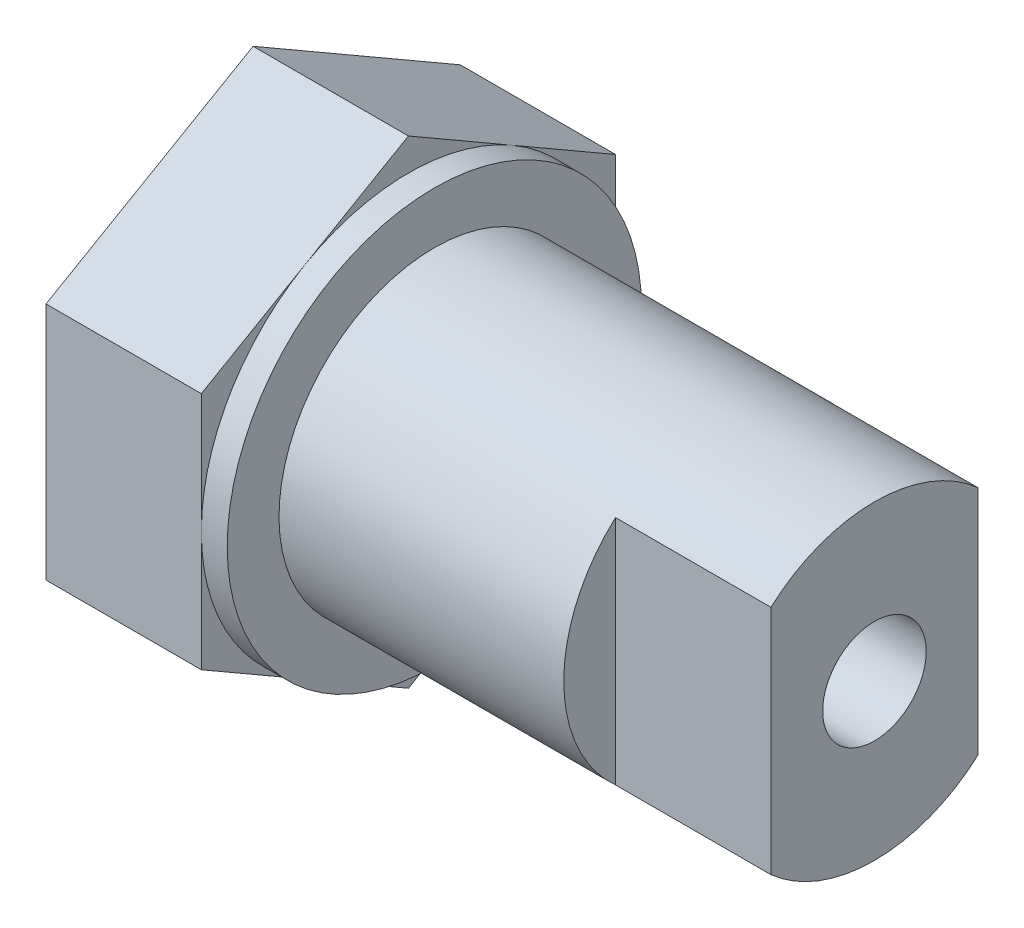
ISO-10303-21;
HEADER;
FILE_DESCRIPTION(('STEP AP214'),'2;1');
FILE_NAME('part.step','',(''),(''),'','','');
FILE_SCHEMA(('AUTOMOTIVE_DESIGN { 1 0 10303 214 1 1 1 1 }'));
ENDSEC;
DATA;
#1=APPLICATION_CONTEXT('core data for automotive mechanical design processes');
#2=APPLICATION_PROTOCOL_DEFINITION('international standard','automotive_design',2000,#1);
#3=PRODUCT_CONTEXT('',#1,'mechanical');
#4=PRODUCT('Part','Part','',(#3));
#5=PRODUCT_RELATED_PRODUCT_CATEGORY('part','',(#4));
#6=PRODUCT_DEFINITION_FORMATION('','',#4);
#7=PRODUCT_DEFINITION_CONTEXT('part definition',#1,'design');
#8=PRODUCT_DEFINITION('design','',#6,#7);
#9=PRODUCT_DEFINITION_SHAPE('','',#8);
#10=(LENGTH_UNIT() NAMED_UNIT(*) SI_UNIT(.MILLI.,.METRE.));
#11=(NAMED_UNIT(*) PLANE_ANGLE_UNIT() SI_UNIT($,.RADIAN.));
#12=(NAMED_UNIT(*) SI_UNIT($,.STERADIAN.) SOLID_ANGLE_UNIT());
#13=UNCERTAINTY_MEASURE_WITH_UNIT(LENGTH_MEASURE(1.E-05),#10,'distance_accuracy_value','');
#14=(GEOMETRIC_REPRESENTATION_CONTEXT(3) GLOBAL_UNCERTAINTY_ASSIGNED_CONTEXT((#13)) GLOBAL_UNIT_ASSIGNED_CONTEXT((#10,
#11,#12)) REPRESENTATION_CONTEXT('',''));
#15=CARTESIAN_POINT('',(0.,0.,0.));
#16=DIRECTION('',(0.,0.,1.));
#17=DIRECTION('',(1.,0.,0.));
#18=AXIS2_PLACEMENT_3D('',#15,#16,#17);
#19=CARTESIAN_POINT('',(114.3,0.,0.));
#20=DIRECTION('',(-1.,0.,0.));
#21=DIRECTION('',(0.,0.,1.));
#22=AXIS2_PLACEMENT_3D('',#19,#20,#21);
#23=CYLINDRICAL_SURFACE('',#22,38.1);
#24=CARTESIAN_POINT('',(6.35,0.,0.));
#25=DIRECTION('',(1.,0.,0.));
#26=DIRECTION('',(0.,0.,-1.));
#27=AXIS2_PLACEMENT_3D('',#24,#25,#26);
#28=CIRCLE('',#27,38.1);
#29=CARTESIAN_POINT('',(6.35,0.,-38.1));
#30=VERTEX_POINT('',#29);
#31=EDGE_CURVE('E11',#30,#30,#28,.T.);
#32=ORIENTED_EDGE('',*,*,#31,.T.);
#33=EDGE_LOOP('',(#32));
#34=FACE_BOUND('',#33,.T.);
#35=DIRECTION('',(1.,0.,0.));
#36=VECTOR('',#35,1.);
#37=CARTESIAN_POINT('',(76.2,28.3980633142473,25.4));
#38=LINE('',#37,#36);
#39=CARTESIAN_POINT('',(76.2,28.3980633142473,25.4));
#40=VERTEX_POINT('',#39);
#41=CARTESIAN_POINT('',(114.3,28.3980633142473,25.4));
#42=VERTEX_POINT('',#41);
#43=EDGE_CURVE('E135',#40,#42,#38,.T.);
#44=ORIENTED_EDGE('',*,*,#43,.T.);
#45=CARTESIAN_POINT('',(114.3,0.,0.));
#46=DIRECTION('',(1.,0.,0.));
#47=DIRECTION('',(0.,0.,-1.));
#48=AXIS2_PLACEMENT_3D('',#45,#46,#47);
#49=CIRCLE('',#48,38.1);
#50=CARTESIAN_POINT('',(114.3,28.3980633142473,-25.4));
#51=VERTEX_POINT('',#50);
#52=EDGE_CURVE('E173',#51,#42,#49,.T.);
#53=ORIENTED_EDGE('',*,*,#52,.F.);
#54=DIRECTION('',(1.,0.,0.));
#55=VECTOR('',#54,1.);
#56=CARTESIAN_POINT('',(76.2,28.3980633142473,-25.4));
#57=LINE('',#56,#55);
#58=CARTESIAN_POINT('',(76.2,28.3980633142473,-25.4));
#59=VERTEX_POINT('',#58);
#60=EDGE_CURVE('E64',#59,#51,#57,.T.);
#61=ORIENTED_EDGE('',*,*,#60,.F.);
#62=CARTESIAN_POINT('',(76.2,0.,0.));
#63=DIRECTION('',(1.,0.,0.));
#64=DIRECTION('',(0.,0.,-1.));
#65=AXIS2_PLACEMENT_3D('',#62,#63,#64);
#66=CIRCLE('',#65,38.1);
#67=CARTESIAN_POINT('',(76.2,-28.3980633142473,-25.4));
#68=VERTEX_POINT('',#67);
#69=EDGE_CURVE('E157',#68,#59,#66,.T.);
#70=ORIENTED_EDGE('',*,*,#69,.F.);
#71=DIRECTION('',(1.,0.,0.));
#72=VECTOR('',#71,1.);
#73=CARTESIAN_POINT('',(76.2,-28.3980633142473,-25.4));
#74=LINE('',#73,#72);
#75=CARTESIAN_POINT('',(114.3,-28.3980633142473,-25.4));
#76=VERTEX_POINT('',#75);
#77=EDGE_CURVE('E154',#68,#76,#74,.T.);
#78=ORIENTED_EDGE('',*,*,#77,.T.);
#79=CARTESIAN_POINT('',(114.3,-28.3980633142473,25.4));
#80=VERTEX_POINT('',#79);
#81=EDGE_CURVE('E170',#80,#76,#49,.T.);
#82=ORIENTED_EDGE('',*,*,#81,.F.);
#83=DIRECTION('',(1.,0.,0.));
#84=VECTOR('',#83,1.);
#85=CARTESIAN_POINT('',(76.2,-28.3980633142473,25.4));
#86=LINE('',#85,#84);
#87=CARTESIAN_POINT('',(76.2,-28.3980633142473,25.4));
#88=VERTEX_POINT('',#87);
#89=EDGE_CURVE('E56',#88,#80,#86,.T.);
#90=ORIENTED_EDGE('',*,*,#89,.F.);
#91=CARTESIAN_POINT('',(76.2,0.,0.));
#92=DIRECTION('',(1.,0.,0.));
#93=DIRECTION('',(0.,0.,-1.));
#94=AXIS2_PLACEMENT_3D('',#91,#92,#93);
#95=CIRCLE('',#94,38.1);
#96=EDGE_CURVE('E145',#40,#88,#95,.T.);
#97=ORIENTED_EDGE('',*,*,#96,.F.);
#98=EDGE_LOOP('',(#44,#53,#61,#70,#78,#82,#90,#97));
#99=FACE_BOUND('',#98,.T.);
#100=ADVANCED_FACE('F39',(#34,#99),#23,.T.);
#101=CARTESIAN_POINT('',(114.3,0.,0.));
#102=DIRECTION('',(1.,0.,0.));
#103=DIRECTION('',(0.,0.,-1.));
#104=AXIS2_PLACEMENT_3D('',#101,#102,#103);
#105=PLANE('',#104);
#106=CARTESIAN_POINT('',(114.3,0.,0.));
#107=DIRECTION('',(1.,0.,0.));
#108=DIRECTION('',(0.,0.,-1.));
#109=AXIS2_PLACEMENT_3D('',#106,#107,#108);
#110=CIRCLE('',#109,12.7);
#111=CARTESIAN_POINT('',(114.3,0.,-12.7));
#112=VERTEX_POINT('',#111);
#113=EDGE_CURVE('E155',#112,#112,#110,.T.);
#114=ORIENTED_EDGE('',*,*,#113,.F.);
#115=EDGE_LOOP('',(#114));
#116=FACE_BOUND('',#115,.T.);
#117=ORIENTED_EDGE('',*,*,#52,.T.);
#118=DIRECTION('',(0.,-1.,0.));
#119=VECTOR('',#118,1.);
#120=CARTESIAN_POINT('',(114.3,0.,25.4));
#121=LINE('',#120,#119);
#122=EDGE_CURVE('E140',#42,#80,#121,.T.);
#123=ORIENTED_EDGE('',*,*,#122,.T.);
#124=ORIENTED_EDGE('',*,*,#81,.T.);
#125=DIRECTION('',(0.,-1.,0.));
#126=VECTOR('',#125,1.);
#127=CARTESIAN_POINT('',(114.3,0.,-25.4));
#128=LINE('',#127,#126);
#129=EDGE_CURVE('E160',#51,#76,#128,.T.);
#130=ORIENTED_EDGE('',*,*,#129,.F.);
#131=EDGE_LOOP('',(#117,#123,#124,#130));
#132=FACE_BOUND('',#131,.T.);
#133=ADVANCED_FACE('F283',(#116,#132),#105,.T.);
#134=CARTESIAN_POINT('',(0.,0.,0.));
#135=DIRECTION('',(1.,0.,0.));
#136=DIRECTION('',(0.,0.,-1.));
#137=AXIS2_PLACEMENT_3D('',#134,#135,#136);
#138=PLANE('',#137);
#139=CARTESIAN_POINT('',(0.,0.,0.));
#140=DIRECTION('',(1.,0.,0.));
#141=DIRECTION('',(0.,0.,-1.));
#142=AXIS2_PLACEMENT_3D('',#139,#140,#141);
#143=CIRCLE('',#142,50.8);
#144=CARTESIAN_POINT('',(0.,0.,-50.8));
#145=VERTEX_POINT('',#144);
#146=CARTESIAN_POINT('',(0.,43.9940905122495,-25.4));
#147=VERTEX_POINT('',#146);
#148=EDGE_CURVE('E174',#145,#147,#143,.T.);
#149=ORIENTED_EDGE('',*,*,#148,.F.);
#150=DIRECTION('',(0.,1.,0.));
#151=VECTOR('',#150,1.);
#152=CARTESIAN_POINT('',(0.,0.,-50.8));
#153=LINE('',#152,#151);
#154=CARTESIAN_POINT('',(0.,29.329393674833,-50.8));
#155=VERTEX_POINT('',#154);
#156=EDGE_CURVE('E213',#145,#155,#153,.T.);
#157=ORIENTED_EDGE('',*,*,#156,.T.);
#158=DIRECTION('',(0.,0.5,0.866025403784438));
#159=VECTOR('',#158,1.);
#160=CARTESIAN_POINT('',(0.,43.9940905122495,-25.4));
#161=LINE('',#160,#159);
#162=EDGE_CURVE('E217',#155,#147,#161,.T.);
#163=ORIENTED_EDGE('',*,*,#162,.T.);
#164=EDGE_LOOP('',(#149,#157,#163));
#165=FACE_BOUND('',#164,.T.);
#166=ADVANCED_FACE('F281',(#165),#138,.T.);
#167=CARTESIAN_POINT('',(0.,43.9940905122495,25.4));
#168=VERTEX_POINT('',#167);
#169=EDGE_CURVE('E48',#147,#168,#143,.T.);
#170=ORIENTED_EDGE('',*,*,#169,.F.);
#171=CARTESIAN_POINT('',(0.,58.658787349666,0.));
#172=VERTEX_POINT('',#171);
#173=EDGE_CURVE('E216',#147,#172,#161,.T.);
#174=ORIENTED_EDGE('',*,*,#173,.T.);
#175=DIRECTION('',(0.,-0.499999999999999,0.866025403784439));
#176=VECTOR('',#175,1.);
#177=CARTESIAN_POINT('',(0.,43.9940905122495,25.4));
#178=LINE('',#177,#176);
#179=EDGE_CURVE('E187',#172,#168,#178,.T.);
#180=ORIENTED_EDGE('',*,*,#179,.T.);
#181=EDGE_LOOP('',(#170,#174,#180));
#182=FACE_BOUND('',#181,.T.);
#183=ADVANCED_FACE('F322',(#182),#138,.T.);
#184=CARTESIAN_POINT('',(0.,0.,50.8));
#185=VERTEX_POINT('',#184);
#186=EDGE_CURVE('E258',#168,#185,#143,.T.);
#187=ORIENTED_EDGE('',*,*,#186,.F.);
#188=CARTESIAN_POINT('',(0.,29.3293936748331,50.8));
#189=VERTEX_POINT('',#188);
#190=EDGE_CURVE('E220',#168,#189,#178,.T.);
#191=ORIENTED_EDGE('',*,*,#190,.T.);
#192=DIRECTION('',(0.,-1.,0.));
#193=VECTOR('',#192,1.);
#194=CARTESIAN_POINT('',(0.,0.,50.8));
#195=LINE('',#194,#193);
#196=EDGE_CURVE('E202',#189,#185,#195,.T.);
#197=ORIENTED_EDGE('',*,*,#196,.T.);
#198=EDGE_LOOP('',(#187,#191,#197));
#199=FACE_BOUND('',#198,.T.);
#200=ADVANCED_FACE('F276',(#199),#138,.T.);
#201=CARTESIAN_POINT('',(0.,-43.9940905122495,25.4));
#202=VERTEX_POINT('',#201);
#203=EDGE_CURVE('E250',#185,#202,#143,.T.);
#204=ORIENTED_EDGE('',*,*,#203,.F.);
#205=CARTESIAN_POINT('',(0.,-29.329393674833,50.8));
#206=VERTEX_POINT('',#205);
#207=EDGE_CURVE('E179',#185,#206,#195,.T.);
#208=ORIENTED_EDGE('',*,*,#207,.T.);
#209=DIRECTION('',(0.,-0.500000000000001,-0.866025403784438));
#210=VECTOR('',#209,1.);
#211=CARTESIAN_POINT('',(0.,-43.9940905122495,25.4));
#212=LINE('',#211,#210);
#213=EDGE_CURVE('E206',#206,#202,#212,.T.);
#214=ORIENTED_EDGE('',*,*,#213,.T.);
#215=EDGE_LOOP('',(#204,#208,#214));
#216=FACE_BOUND('',#215,.T.);
#217=ADVANCED_FACE('F249',(#216),#138,.T.);
#218=CARTESIAN_POINT('',(0.,-43.9940905122495,-25.4));
#219=VERTEX_POINT('',#218);
#220=EDGE_CURVE('E256',#202,#219,#143,.T.);
#221=ORIENTED_EDGE('',*,*,#220,.F.);
#222=CARTESIAN_POINT('',(0.,-58.658787349666,0.));
#223=VERTEX_POINT('',#222);
#224=EDGE_CURVE('E205',#202,#223,#212,.T.);
#225=ORIENTED_EDGE('',*,*,#224,.T.);
#226=DIRECTION('',(0.,0.499999999999999,-0.866025403784439));
#227=VECTOR('',#226,1.);
#228=CARTESIAN_POINT('',(0.,-43.9940905122495,-25.4));
#229=LINE('',#228,#227);
#230=EDGE_CURVE('E210',#223,#219,#229,.T.);
#231=ORIENTED_EDGE('',*,*,#230,.T.);
#232=EDGE_LOOP('',(#221,#225,#231));
#233=FACE_BOUND('',#232,.T.);
#234=ADVANCED_FACE('F268',(#233),#138,.T.);
#235=CARTESIAN_POINT('',(-38.1,0.,50.8));
#236=DIRECTION('',(0.,0.,1.));
#237=DIRECTION('',(0.,-1.,0.));
#238=AXIS2_PLACEMENT_3D('',#235,#236,#237);
#239=PLANE('',#238);
#240=ORIENTED_EDGE('',*,*,#196,.F.);
#241=DIRECTION('',(1.,0.,0.));
#242=VECTOR('',#241,1.);
#243=CARTESIAN_POINT('',(-38.1,29.3293936748331,50.8));
#244=LINE('',#243,#242);
#245=CARTESIAN_POINT('',(-38.1,29.3293936748331,50.8));
#246=VERTEX_POINT('',#245);
#247=EDGE_CURVE('E223',#246,#189,#244,.T.);
#248=ORIENTED_EDGE('',*,*,#247,.F.);
#249=DIRECTION('',(0.,-1.,0.));
#250=VECTOR('',#249,1.);
#251=CARTESIAN_POINT('',(-38.1,0.,50.8));
#252=LINE('',#251,#250);
#253=CARTESIAN_POINT('',(-38.1,-29.329393674833,50.8));
#254=VERTEX_POINT('',#253);
#255=EDGE_CURVE('E183',#246,#254,#252,.T.);
#256=ORIENTED_EDGE('',*,*,#255,.T.);
#257=DIRECTION('',(1.,0.,0.));
#258=VECTOR('',#257,1.);
#259=CARTESIAN_POINT('',(-38.1,-29.329393674833,50.8));
#260=LINE('',#259,#258);
#261=EDGE_CURVE('E43',#254,#206,#260,.T.);
#262=ORIENTED_EDGE('',*,*,#261,.T.);
#263=ORIENTED_EDGE('',*,*,#207,.F.);
#264=EDGE_LOOP('',(#240,#248,#256,#262,#263));
#265=FACE_BOUND('',#264,.T.);
#266=ADVANCED_FACE('F41',(#265),#239,.T.);
#267=CARTESIAN_POINT('',(-38.1,43.9940905122495,25.4));
#268=DIRECTION('',(0.,0.866025403784439,0.499999999999999));
#269=DIRECTION('',(0.,-0.499999999999999,0.866025403784439));
#270=AXIS2_PLACEMENT_3D('',#267,#268,#269);
#271=PLANE('',#270);
#272=ORIENTED_EDGE('',*,*,#179,.F.);
#273=DIRECTION('',(1.,0.,0.));
#274=VECTOR('',#273,1.);
#275=CARTESIAN_POINT('',(-38.1,58.658787349666,0.));
#276=LINE('',#275,#274);
#277=CARTESIAN_POINT('',(-38.1,58.658787349666,0.));
#278=VERTEX_POINT('',#277);
#279=EDGE_CURVE('E226',#278,#172,#276,.T.);
#280=ORIENTED_EDGE('',*,*,#279,.F.);
#281=DIRECTION('',(0.,-0.499999999999999,0.866025403784439));
#282=VECTOR('',#281,1.);
#283=CARTESIAN_POINT('',(-38.1,43.9940905122495,25.4));
#284=LINE('',#283,#282);
#285=EDGE_CURVE('E199',#278,#246,#284,.T.);
#286=ORIENTED_EDGE('',*,*,#285,.T.);
#287=ORIENTED_EDGE('',*,*,#247,.T.);
#288=ORIENTED_EDGE('',*,*,#190,.F.);
#289=EDGE_LOOP('',(#272,#280,#286,#287,#288));
#290=FACE_BOUND('',#289,.T.);
#291=ADVANCED_FACE('F275',(#290),#271,.T.);
#292=CARTESIAN_POINT('',(-38.1,43.9940905122495,-25.4));
#293=DIRECTION('',(0.,0.866025403784438,-0.5));
#294=DIRECTION('',(0.,0.5,0.866025403784438));
#295=AXIS2_PLACEMENT_3D('',#292,#293,#294);
#296=PLANE('',#295);
#297=ORIENTED_EDGE('',*,*,#162,.F.);
#298=DIRECTION('',(1.,0.,0.));
#299=VECTOR('',#298,1.);
#300=CARTESIAN_POINT('',(-38.1,29.329393674833,-50.8));
#301=LINE('',#300,#299);
#302=CARTESIAN_POINT('',(-38.1,29.329393674833,-50.8));
#303=VERTEX_POINT('',#302);
#304=EDGE_CURVE('E229',#303,#155,#301,.T.);
#305=ORIENTED_EDGE('',*,*,#304,.F.);
#306=DIRECTION('',(0.,0.5,0.866025403784438));
#307=VECTOR('',#306,1.);
#308=CARTESIAN_POINT('',(-38.1,43.9940905122495,-25.4));
#309=LINE('',#308,#307);
#310=EDGE_CURVE('E196',#303,#278,#309,.T.);
#311=ORIENTED_EDGE('',*,*,#310,.T.);
#312=ORIENTED_EDGE('',*,*,#279,.T.);
#313=ORIENTED_EDGE('',*,*,#173,.F.);
#314=EDGE_LOOP('',(#297,#305,#311,#312,#313));
#315=FACE_BOUND('',#314,.T.);
#316=ADVANCED_FACE('F316',(#315),#296,.T.);
#317=CARTESIAN_POINT('',(-38.1,0.,-50.8));
#318=DIRECTION('',(0.,0.,-1.));
#319=DIRECTION('',(0.,1.,0.));
#320=AXIS2_PLACEMENT_3D('',#317,#318,#319);
#321=PLANE('',#320);
#322=CARTESIAN_POINT('',(0.,-29.3293936748331,-50.8));
#323=VERTEX_POINT('',#322);
#324=EDGE_CURVE('E214',#323,#145,#153,.T.);
#325=ORIENTED_EDGE('',*,*,#324,.F.);
#326=DIRECTION('',(1.,0.,0.));
#327=VECTOR('',#326,1.);
#328=CARTESIAN_POINT('',(-38.1,-29.3293936748331,-50.8));
#329=LINE('',#328,#327);
#330=CARTESIAN_POINT('',(-38.1,-29.3293936748331,-50.8));
#331=VERTEX_POINT('',#330);
#332=EDGE_CURVE('E232',#331,#323,#329,.T.);
#333=ORIENTED_EDGE('',*,*,#332,.F.);
#334=DIRECTION('',(0.,1.,0.));
#335=VECTOR('',#334,1.);
#336=CARTESIAN_POINT('',(-38.1,0.,-50.8));
#337=LINE('',#336,#335);
#338=EDGE_CURVE('E193',#331,#303,#337,.T.);
#339=ORIENTED_EDGE('',*,*,#338,.T.);
#340=ORIENTED_EDGE('',*,*,#304,.T.);
#341=ORIENTED_EDGE('',*,*,#156,.F.);
#342=EDGE_LOOP('',(#325,#333,#339,#340,#341));
#343=FACE_BOUND('',#342,.T.);
#344=ADVANCED_FACE('F319',(#343),#321,.T.);
#345=CARTESIAN_POINT('',(-38.1,-43.9940905122495,-25.4));
#346=DIRECTION('',(0.,-0.866025403784439,-0.499999999999999));
#347=DIRECTION('',(0.,0.499999999999999,-0.866025403784439));
#348=AXIS2_PLACEMENT_3D('',#345,#346,#347);
#349=PLANE('',#348);
#350=ORIENTED_EDGE('',*,*,#230,.F.);
#351=DIRECTION('',(1.,0.,0.));
#352=VECTOR('',#351,1.);
#353=CARTESIAN_POINT('',(-38.1,-58.658787349666,0.));
#354=LINE('',#353,#352);
#355=CARTESIAN_POINT('',(-38.1,-58.658787349666,0.));
#356=VERTEX_POINT('',#355);
#357=EDGE_CURVE('E234',#356,#223,#354,.T.);
#358=ORIENTED_EDGE('',*,*,#357,.F.);
#359=DIRECTION('',(0.,0.499999999999999,-0.866025403784439));
#360=VECTOR('',#359,1.);
#361=CARTESIAN_POINT('',(-38.1,-43.9940905122495,-25.4));
#362=LINE('',#361,#360);
#363=EDGE_CURVE('E190',#356,#331,#362,.T.);
#364=ORIENTED_EDGE('',*,*,#363,.T.);
#365=ORIENTED_EDGE('',*,*,#332,.T.);
#366=EDGE_CURVE('E209',#219,#323,#229,.T.);
#367=ORIENTED_EDGE('',*,*,#366,.F.);
#368=EDGE_LOOP('',(#350,#358,#364,#365,#367));
#369=FACE_BOUND('',#368,.T.);
#370=ADVANCED_FACE('F266',(#369),#349,.T.);
#371=CARTESIAN_POINT('',(-38.1,-43.9940905122495,25.4));
#372=DIRECTION('',(0.,-0.866025403784438,0.500000000000001));
#373=DIRECTION('',(0.,-0.500000000000001,-0.866025403784438));
#374=AXIS2_PLACEMENT_3D('',#371,#372,#373);
#375=PLANE('',#374);
#376=ORIENTED_EDGE('',*,*,#213,.F.);
#377=ORIENTED_EDGE('',*,*,#261,.F.);
#378=DIRECTION('',(0.,-0.500000000000001,-0.866025403784438));
#379=VECTOR('',#378,1.);
#380=CARTESIAN_POINT('',(-38.1,-43.9940905122495,25.4));
#381=LINE('',#380,#379);
#382=EDGE_CURVE('E186',#254,#356,#381,.T.);
#383=ORIENTED_EDGE('',*,*,#382,.T.);
#384=ORIENTED_EDGE('',*,*,#357,.T.);
#385=ORIENTED_EDGE('',*,*,#224,.F.);
#386=EDGE_LOOP('',(#376,#377,#383,#384,#385));
#387=FACE_BOUND('',#386,.T.);
#388=ADVANCED_FACE('F246',(#387),#375,.T.);
#389=CARTESIAN_POINT('',(-38.1,0.,0.));
#390=DIRECTION('',(1.,0.,0.));
#391=DIRECTION('',(0.,0.,-1.));
#392=AXIS2_PLACEMENT_3D('',#389,#390,#391);
#393=PLANE('',#392);
#394=CARTESIAN_POINT('',(-38.1,0.,0.));
#395=DIRECTION('',(1.,0.,0.));
#396=DIRECTION('',(0.,0.,-1.));
#397=AXIS2_PLACEMENT_3D('',#394,#395,#396);
#398=CIRCLE('',#397,12.7);
#399=CARTESIAN_POINT('',(-38.1,0.,-12.7));
#400=VERTEX_POINT('',#399);
#401=EDGE_CURVE('E167',#400,#400,#398,.T.);
#402=ORIENTED_EDGE('',*,*,#401,.T.);
#403=EDGE_LOOP('',(#402));
#404=FACE_BOUND('',#403,.T.);
#405=ORIENTED_EDGE('',*,*,#255,.F.);
#406=ORIENTED_EDGE('',*,*,#285,.F.);
#407=ORIENTED_EDGE('',*,*,#310,.F.);
#408=ORIENTED_EDGE('',*,*,#338,.F.);
#409=ORIENTED_EDGE('',*,*,#363,.F.);
#410=ORIENTED_EDGE('',*,*,#382,.F.);
#411=EDGE_LOOP('',(#405,#406,#407,#408,#409,#410));
#412=FACE_BOUND('',#411,.T.);
#413=ADVANCED_FACE('F280',(#404,#412),#393,.F.);
#414=EDGE_CURVE('E182',#219,#145,#143,.T.);
#415=ORIENTED_EDGE('',*,*,#414,.F.);
#416=ORIENTED_EDGE('',*,*,#366,.T.);
#417=ORIENTED_EDGE('',*,*,#324,.T.);
#418=EDGE_LOOP('',(#415,#416,#417));
#419=FACE_BOUND('',#418,.T.);
#420=ADVANCED_FACE('F262',(#419),#138,.T.);
#421=CARTESIAN_POINT('',(6.35,0.,0.));
#422=DIRECTION('',(-1.,0.,0.));
#423=DIRECTION('',(0.,0.,1.));
#424=AXIS2_PLACEMENT_3D('',#421,#422,#423);
#425=CYLINDRICAL_SURFACE('',#424,50.8);
#426=CARTESIAN_POINT('',(6.35,0.,0.));
#427=DIRECTION('',(1.,0.,0.));
#428=DIRECTION('',(0.,0.,-1.));
#429=AXIS2_PLACEMENT_3D('',#426,#427,#428);
#430=CIRCLE('',#429,50.8);
#431=CARTESIAN_POINT('',(6.35,0.,-50.8));
#432=VERTEX_POINT('',#431);
#433=EDGE_CURVE('E176',#432,#432,#430,.T.);
#434=ORIENTED_EDGE('',*,*,#433,.F.);
#435=EDGE_LOOP('',(#434));
#436=FACE_BOUND('',#435,.T.);
#437=ORIENTED_EDGE('',*,*,#148,.T.);
#438=ORIENTED_EDGE('',*,*,#169,.T.);
#439=ORIENTED_EDGE('',*,*,#186,.T.);
#440=ORIENTED_EDGE('',*,*,#203,.T.);
#441=ORIENTED_EDGE('',*,*,#220,.T.);
#442=ORIENTED_EDGE('',*,*,#414,.T.);
#443=EDGE_LOOP('',(#437,#438,#439,#440,#441,#442));
#444=FACE_BOUND('',#443,.T.);
#445=ADVANCED_FACE('F254',(#436,#444),#425,.T.);
#446=CARTESIAN_POINT('',(6.35,0.,0.));
#447=DIRECTION('',(1.,0.,0.));
#448=DIRECTION('',(0.,0.,-1.));
#449=AXIS2_PLACEMENT_3D('',#446,#447,#448);
#450=PLANE('',#449);
#451=ORIENTED_EDGE('',*,*,#31,.F.);
#452=EDGE_LOOP('',(#451));
#453=FACE_BOUND('',#452,.T.);
#454=ORIENTED_EDGE('',*,*,#433,.T.);
#455=EDGE_LOOP('',(#454));
#456=FACE_BOUND('',#455,.T.);
#457=ADVANCED_FACE('F293',(#453,#456),#450,.T.);
#458=CARTESIAN_POINT('',(-38.1,0.,0.));
#459=DIRECTION('',(1.,0.,0.));
#460=DIRECTION('',(0.,0.,-1.));
#461=AXIS2_PLACEMENT_3D('',#458,#459,#460);
#462=CYLINDRICAL_SURFACE('',#461,12.7);
#463=ORIENTED_EDGE('',*,*,#401,.F.);
#464=EDGE_LOOP('',(#463));
#465=FACE_BOUND('',#464,.T.);
#466=ORIENTED_EDGE('',*,*,#113,.T.);
#467=EDGE_LOOP('',(#466));
#468=FACE_BOUND('',#467,.T.);
#469=ADVANCED_FACE('F296',(#465,#468),#462,.F.);
#470=CARTESIAN_POINT('',(76.2,0.,-25.4));
#471=DIRECTION('',(0.,0.,1.));
#472=DIRECTION('',(1.,0.,0.));
#473=AXIS2_PLACEMENT_3D('',#470,#471,#472);
#474=PLANE('',#473);
#475=ORIENTED_EDGE('',*,*,#129,.T.);
#476=ORIENTED_EDGE('',*,*,#77,.F.);
#477=DIRECTION('',(0.,-1.,0.));
#478=VECTOR('',#477,1.);
#479=CARTESIAN_POINT('',(76.2,0.,-25.4));
#480=LINE('',#479,#478);
#481=EDGE_CURVE('E159',#59,#68,#480,.T.);
#482=ORIENTED_EDGE('',*,*,#481,.F.);
#483=ORIENTED_EDGE('',*,*,#60,.T.);
#484=EDGE_LOOP('',(#475,#476,#482,#483));
#485=FACE_BOUND('',#484,.T.);
#486=ADVANCED_FACE('F344',(#485),#474,.F.);
#487=CARTESIAN_POINT('',(76.2,0.,0.));
#488=DIRECTION('',(1.,0.,0.));
#489=DIRECTION('',(0.,0.,-1.));
#490=AXIS2_PLACEMENT_3D('',#487,#488,#489);
#491=PLANE('',#490);
#492=ORIENTED_EDGE('',*,*,#69,.T.);
#493=ORIENTED_EDGE('',*,*,#481,.T.);
#494=EDGE_LOOP('',(#492,#493));
#495=FACE_BOUND('',#494,.T.);
#496=ADVANCED_FACE('F349',(#495),#491,.T.);
#497=CARTESIAN_POINT('',(76.2,0.,25.4));
#498=DIRECTION('',(0.,0.,1.));
#499=DIRECTION('',(1.,0.,0.));
#500=AXIS2_PLACEMENT_3D('',#497,#498,#499);
#501=PLANE('',#500);
#502=ORIENTED_EDGE('',*,*,#122,.F.);
#503=ORIENTED_EDGE('',*,*,#43,.F.);
#504=DIRECTION('',(0.,-1.,0.));
#505=VECTOR('',#504,1.);
#506=CARTESIAN_POINT('',(76.2,0.,25.4));
#507=LINE('',#506,#505);
#508=EDGE_CURVE('E138',#40,#88,#507,.T.);
#509=ORIENTED_EDGE('',*,*,#508,.T.);
#510=ORIENTED_EDGE('',*,*,#89,.T.);
#511=EDGE_LOOP('',(#502,#503,#509,#510));
#512=FACE_BOUND('',#511,.T.);
#513=ADVANCED_FACE('F137',(#512),#501,.T.);
#514=CARTESIAN_POINT('',(76.2,0.,0.));
#515=DIRECTION('',(1.,0.,0.));
#516=DIRECTION('',(0.,0.,-1.));
#517=AXIS2_PLACEMENT_3D('',#514,#515,#516);
#518=PLANE('',#517);
#519=ORIENTED_EDGE('',*,*,#508,.F.);
#520=ORIENTED_EDGE('',*,*,#96,.T.);
#521=EDGE_LOOP('',(#519,#520));
#522=FACE_BOUND('',#521,.T.);
#523=ADVANCED_FACE('F148',(#522),#518,.T.);
#524=CLOSED_SHELL('',(#100,#133,#166,#183,#200,#217,#234,#266,#291,#316,#344,#370,#388,#413,
#420,#445,#457,#469,#486,#496,#513,#523));
#525=MANIFOLD_SOLID_BREP('B2',#524);
#526=ADVANCED_BREP_SHAPE_REPRESENTATION('',(#18,#525),#14);
#527=SHAPE_DEFINITION_REPRESENTATION(#9,#526);
ENDSEC;
END-ISO-10303-21;
